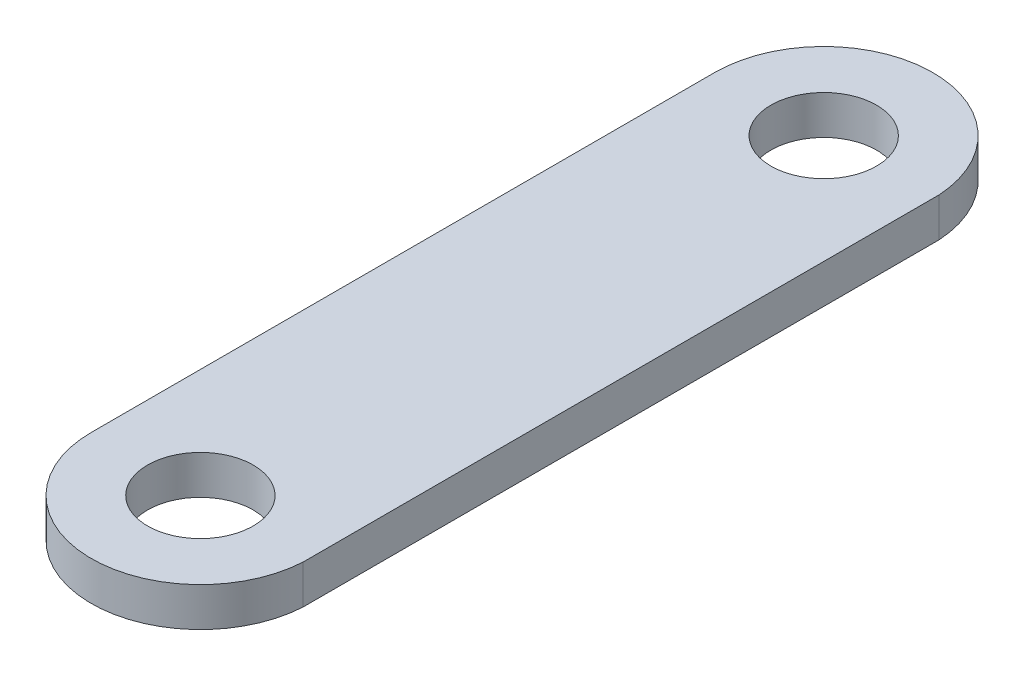
ISO-10303-21;
HEADER;
FILE_DESCRIPTION(('STEP AP214'),'2;1');
FILE_NAME('part.step','',(''),(''),'','','');
FILE_SCHEMA(('AUTOMOTIVE_DESIGN { 1 0 10303 214 1 1 1 1 }'));
ENDSEC;
DATA;
#1=APPLICATION_CONTEXT('core data for automotive mechanical design processes');
#2=APPLICATION_PROTOCOL_DEFINITION('international standard','automotive_design',2000,#1);
#3=PRODUCT_CONTEXT('',#1,'mechanical');
#4=PRODUCT('Part','Part','',(#3));
#5=PRODUCT_RELATED_PRODUCT_CATEGORY('part','',(#4));
#6=PRODUCT_DEFINITION_FORMATION('','',#4);
#7=PRODUCT_DEFINITION_CONTEXT('part definition',#1,'design');
#8=PRODUCT_DEFINITION('design','',#6,#7);
#9=PRODUCT_DEFINITION_SHAPE('','',#8);
#10=(LENGTH_UNIT() NAMED_UNIT(*) SI_UNIT(.MILLI.,.METRE.));
#11=(NAMED_UNIT(*) PLANE_ANGLE_UNIT() SI_UNIT($,.RADIAN.));
#12=(NAMED_UNIT(*) SI_UNIT($,.STERADIAN.) SOLID_ANGLE_UNIT());
#13=UNCERTAINTY_MEASURE_WITH_UNIT(LENGTH_MEASURE(1.E-05),#10,'distance_accuracy_value','');
#14=(GEOMETRIC_REPRESENTATION_CONTEXT(3) GLOBAL_UNCERTAINTY_ASSIGNED_CONTEXT((#13)) GLOBAL_UNIT_ASSIGNED_CONTEXT((#10,
#11,#12)) REPRESENTATION_CONTEXT('',''));
#15=CARTESIAN_POINT('',(0.,0.,0.));
#16=DIRECTION('',(0.,0.,1.));
#17=DIRECTION('',(1.,0.,0.));
#18=AXIS2_PLACEMENT_3D('',#15,#16,#17);
#19=CARTESIAN_POINT('',(0.00391637381463624,1.5875,-12.7));
#20=DIRECTION('',(0.,-1.,0.));
#21=DIRECTION('',(0.,0.,-1.));
#22=AXIS2_PLACEMENT_3D('',#19,#20,#21);
#23=PLANE('',#22);
#24=CARTESIAN_POINT('',(0.00391637381463624,1.5875,-12.7));
#25=DIRECTION('',(0.,1.,0.));
#26=DIRECTION('',(0.,0.,-1.));
#27=AXIS2_PLACEMENT_3D('',#24,#25,#26);
#28=CIRCLE('',#27,4.44891637381463);
#29=CARTESIAN_POINT('',(4.445,1.5875,-12.9638808943903));
#30=VERTEX_POINT('',#29);
#31=CARTESIAN_POINT('',(-4.445,1.5875,-12.7));
#32=VERTEX_POINT('',#31);
#33=EDGE_CURVE('E92',#30,#32,#28,.T.);
#34=ORIENTED_EDGE('',*,*,#33,.T.);
#35=DIRECTION('',(0.,0.,1.));
#36=VECTOR('',#35,1.);
#37=CARTESIAN_POINT('',(-4.445,1.5875,-12.7));
#38=LINE('',#37,#36);
#39=CARTESIAN_POINT('',(-4.445,1.5875,12.7));
#40=VERTEX_POINT('',#39);
#41=EDGE_CURVE('E87',#32,#40,#38,.T.);
#42=ORIENTED_EDGE('',*,*,#41,.T.);
#43=CARTESIAN_POINT('',(0.00391637381463624,1.5875,12.7));
#44=DIRECTION('',(0.,1.,0.));
#45=DIRECTION('',(0.,0.,1.));
#46=AXIS2_PLACEMENT_3D('',#43,#44,#45);
#47=CIRCLE('',#46,4.44891637381463);
#48=CARTESIAN_POINT('',(4.445,1.5875,12.9638808943903));
#49=VERTEX_POINT('',#48);
#50=EDGE_CURVE('E90',#40,#49,#47,.T.);
#51=ORIENTED_EDGE('',*,*,#50,.T.);
#52=DIRECTION('',(0.,0.,-1.));
#53=VECTOR('',#52,1.);
#54=CARTESIAN_POINT('',(4.445,1.5875,-12.9638808943903));
#55=LINE('',#54,#53);
#56=EDGE_CURVE('E57',#49,#30,#55,.T.);
#57=ORIENTED_EDGE('',*,*,#56,.T.);
#58=EDGE_LOOP('',(#34,#42,#51,#57));
#59=FACE_BOUND('',#58,.T.);
#60=CARTESIAN_POINT('',(0.00391637381463624,1.5875,12.7));
#61=DIRECTION('',(0.,1.,0.));
#62=DIRECTION('',(0.,0.,-1.));
#63=AXIS2_PLACEMENT_3D('',#60,#61,#62);
#64=CIRCLE('',#63,2.15265);
#65=CARTESIAN_POINT('',(0.00391637381463624,1.5875,10.54735));
#66=VERTEX_POINT('',#65);
#67=EDGE_CURVE('E112',#66,#66,#64,.T.);
#68=ORIENTED_EDGE('',*,*,#67,.F.);
#69=EDGE_LOOP('',(#68));
#70=FACE_BOUND('',#69,.T.);
#71=CARTESIAN_POINT('',(0.00391637381463624,1.5875,-12.7));
#72=DIRECTION('',(0.,1.,0.));
#73=DIRECTION('',(0.,0.,1.));
#74=AXIS2_PLACEMENT_3D('',#71,#72,#73);
#75=CIRCLE('',#74,2.15265);
#76=CARTESIAN_POINT('',(0.00391637381463624,1.5875,-10.54735));
#77=VERTEX_POINT('',#76);
#78=EDGE_CURVE('E134',#77,#77,#75,.T.);
#79=ORIENTED_EDGE('',*,*,#78,.F.);
#80=EDGE_LOOP('',(#79));
#81=FACE_BOUND('',#80,.T.);
#82=ADVANCED_FACE('F39',(#59,#70,#81),#23,.F.);
#83=CARTESIAN_POINT('',(0.00391637381463624,0.,-12.7));
#84=DIRECTION('',(0.,-1.,0.));
#85=DIRECTION('',(0.,0.,-1.));
#86=AXIS2_PLACEMENT_3D('',#83,#84,#85);
#87=PLANE('',#86);
#88=CARTESIAN_POINT('',(0.00391637381463624,0.,12.7));
#89=DIRECTION('',(0.,1.,0.));
#90=DIRECTION('',(0.,0.,-1.));
#91=AXIS2_PLACEMENT_3D('',#88,#89,#90);
#92=CIRCLE('',#91,2.15265);
#93=CARTESIAN_POINT('',(0.00391637381463624,0.,10.54735));
#94=VERTEX_POINT('',#93);
#95=EDGE_CURVE('E130',#94,#94,#92,.T.);
#96=ORIENTED_EDGE('',*,*,#95,.T.);
#97=EDGE_LOOP('',(#96));
#98=FACE_BOUND('',#97,.T.);
#99=CARTESIAN_POINT('',(0.00391637381463624,0.,-12.7));
#100=DIRECTION('',(0.,1.,0.));
#101=DIRECTION('',(0.,0.,-1.));
#102=AXIS2_PLACEMENT_3D('',#99,#100,#101);
#103=CIRCLE('',#102,4.44891637381463);
#104=CARTESIAN_POINT('',(4.445,0.,-12.9638808943903));
#105=VERTEX_POINT('',#104);
#106=CARTESIAN_POINT('',(-4.445,0.,-12.7));
#107=VERTEX_POINT('',#106);
#108=EDGE_CURVE('E108',#105,#107,#103,.T.);
#109=ORIENTED_EDGE('',*,*,#108,.F.);
#110=DIRECTION('',(0.,0.,-1.));
#111=VECTOR('',#110,1.);
#112=CARTESIAN_POINT('',(4.445,0.,-12.9638808943903));
#113=LINE('',#112,#111);
#114=CARTESIAN_POINT('',(4.445,0.,12.9638808943903));
#115=VERTEX_POINT('',#114);
#116=EDGE_CURVE('E80',#115,#105,#113,.T.);
#117=ORIENTED_EDGE('',*,*,#116,.F.);
#118=CARTESIAN_POINT('',(0.00391637381463624,0.,12.7));
#119=DIRECTION('',(0.,1.,0.));
#120=DIRECTION('',(0.,0.,1.));
#121=AXIS2_PLACEMENT_3D('',#118,#119,#120);
#122=CIRCLE('',#121,4.44891637381463);
#123=CARTESIAN_POINT('',(-4.445,0.,12.7));
#124=VERTEX_POINT('',#123);
#125=EDGE_CURVE('E74',#124,#115,#122,.T.);
#126=ORIENTED_EDGE('',*,*,#125,.F.);
#127=DIRECTION('',(0.,0.,1.));
#128=VECTOR('',#127,1.);
#129=CARTESIAN_POINT('',(-4.445,0.,-12.7));
#130=LINE('',#129,#128);
#131=EDGE_CURVE('E97',#107,#124,#130,.T.);
#132=ORIENTED_EDGE('',*,*,#131,.F.);
#133=EDGE_LOOP('',(#109,#117,#126,#132));
#134=FACE_BOUND('',#133,.T.);
#135=CARTESIAN_POINT('',(0.00391637381463624,0.,-12.7));
#136=DIRECTION('',(0.,1.,0.));
#137=DIRECTION('',(0.,0.,1.));
#138=AXIS2_PLACEMENT_3D('',#135,#136,#137);
#139=CIRCLE('',#138,2.15265);
#140=CARTESIAN_POINT('',(0.00391637381463624,0.,-10.54735));
#141=VERTEX_POINT('',#140);
#142=EDGE_CURVE('E138',#141,#141,#139,.T.);
#143=ORIENTED_EDGE('',*,*,#142,.T.);
#144=EDGE_LOOP('',(#143));
#145=FACE_BOUND('',#144,.T.);
#146=ADVANCED_FACE('F125',(#98,#134,#145),#87,.T.);
#147=CARTESIAN_POINT('',(0.00391637381463624,1.5875,-12.7));
#148=DIRECTION('',(0.,-1.,0.));
#149=DIRECTION('',(0.,0.,-1.));
#150=AXIS2_PLACEMENT_3D('',#147,#148,#149);
#151=CYLINDRICAL_SURFACE('',#150,4.44891637381463);
#152=ORIENTED_EDGE('',*,*,#108,.T.);
#153=DIRECTION('',(0.,-1.,0.));
#154=VECTOR('',#153,1.);
#155=CARTESIAN_POINT('',(-4.445,1.5875,-12.7));
#156=LINE('',#155,#154);
#157=EDGE_CURVE('E11',#32,#107,#156,.T.);
#158=ORIENTED_EDGE('',*,*,#157,.F.);
#159=ORIENTED_EDGE('',*,*,#33,.F.);
#160=DIRECTION('',(0.,-1.,0.));
#161=VECTOR('',#160,1.);
#162=CARTESIAN_POINT('',(4.445,1.5875,-12.9638808943903));
#163=LINE('',#162,#161);
#164=EDGE_CURVE('E104',#30,#105,#163,.T.);
#165=ORIENTED_EDGE('',*,*,#164,.T.);
#166=EDGE_LOOP('',(#152,#158,#159,#165));
#167=FACE_BOUND('',#166,.T.);
#168=ADVANCED_FACE('F41',(#167),#151,.T.);
#169=CARTESIAN_POINT('',(-4.445,1.5875,-12.7));
#170=DIRECTION('',(1.,0.,0.));
#171=DIRECTION('',(0.,0.,-1.));
#172=AXIS2_PLACEMENT_3D('',#169,#170,#171);
#173=PLANE('',#172);
#174=ORIENTED_EDGE('',*,*,#131,.T.);
#175=DIRECTION('',(0.,-1.,0.));
#176=VECTOR('',#175,1.);
#177=CARTESIAN_POINT('',(-4.445,1.5875,12.7));
#178=LINE('',#177,#176);
#179=EDGE_CURVE('E49',#40,#124,#178,.T.);
#180=ORIENTED_EDGE('',*,*,#179,.F.);
#181=ORIENTED_EDGE('',*,*,#41,.F.);
#182=ORIENTED_EDGE('',*,*,#157,.T.);
#183=EDGE_LOOP('',(#174,#180,#181,#182));
#184=FACE_BOUND('',#183,.T.);
#185=ADVANCED_FACE('F96',(#184),#173,.F.);
#186=CARTESIAN_POINT('',(0.00391637381463624,1.5875,12.7));
#187=DIRECTION('',(0.,-1.,0.));
#188=DIRECTION('',(0.,0.,-1.));
#189=AXIS2_PLACEMENT_3D('',#186,#187,#188);
#190=CYLINDRICAL_SURFACE('',#189,4.44891637381463);
#191=ORIENTED_EDGE('',*,*,#125,.T.);
#192=DIRECTION('',(0.,-1.,0.));
#193=VECTOR('',#192,1.);
#194=CARTESIAN_POINT('',(4.445,1.5875,12.9638808943903));
#195=LINE('',#194,#193);
#196=EDGE_CURVE('E99',#49,#115,#195,.T.);
#197=ORIENTED_EDGE('',*,*,#196,.F.);
#198=ORIENTED_EDGE('',*,*,#50,.F.);
#199=ORIENTED_EDGE('',*,*,#179,.T.);
#200=EDGE_LOOP('',(#191,#197,#198,#199));
#201=FACE_BOUND('',#200,.T.);
#202=ADVANCED_FACE('F100',(#201),#190,.T.);
#203=CARTESIAN_POINT('',(4.445,1.5875,-12.9638808943903));
#204=DIRECTION('',(-1.,0.,0.));
#205=DIRECTION('',(0.,0.,1.));
#206=AXIS2_PLACEMENT_3D('',#203,#204,#205);
#207=PLANE('',#206);
#208=ORIENTED_EDGE('',*,*,#116,.T.);
#209=ORIENTED_EDGE('',*,*,#164,.F.);
#210=ORIENTED_EDGE('',*,*,#56,.F.);
#211=ORIENTED_EDGE('',*,*,#196,.T.);
#212=EDGE_LOOP('',(#208,#209,#210,#211));
#213=FACE_BOUND('',#212,.T.);
#214=ADVANCED_FACE('F122',(#213),#207,.F.);
#215=CARTESIAN_POINT('',(0.00391637381463624,1.5875,12.7));
#216=DIRECTION('',(0.,-1.,0.));
#217=DIRECTION('',(0.,0.,-1.));
#218=AXIS2_PLACEMENT_3D('',#215,#216,#217);
#219=CYLINDRICAL_SURFACE('',#218,2.15265);
#220=ORIENTED_EDGE('',*,*,#67,.T.);
#221=EDGE_LOOP('',(#220));
#222=FACE_BOUND('',#221,.T.);
#223=ORIENTED_EDGE('',*,*,#95,.F.);
#224=EDGE_LOOP('',(#223));
#225=FACE_BOUND('',#224,.T.);
#226=ADVANCED_FACE('F157',(#222,#225),#219,.F.);
#227=CARTESIAN_POINT('',(0.00391637381463624,1.5875,-12.7));
#228=DIRECTION('',(0.,-1.,0.));
#229=DIRECTION('',(0.,0.,-1.));
#230=AXIS2_PLACEMENT_3D('',#227,#228,#229);
#231=CYLINDRICAL_SURFACE('',#230,2.15265);
#232=ORIENTED_EDGE('',*,*,#78,.T.);
#233=EDGE_LOOP('',(#232));
#234=FACE_BOUND('',#233,.T.);
#235=ORIENTED_EDGE('',*,*,#142,.F.);
#236=EDGE_LOOP('',(#235));
#237=FACE_BOUND('',#236,.T.);
#238=ADVANCED_FACE('F146',(#234,#237),#231,.F.);
#239=CLOSED_SHELL('',(#82,#146,#168,#185,#202,#214,#226,#238));
#240=MANIFOLD_SOLID_BREP('B2',#239);
#241=ADVANCED_BREP_SHAPE_REPRESENTATION('',(#18,#240),#14);
#242=SHAPE_DEFINITION_REPRESENTATION(#9,#241);
ENDSEC;
END-ISO-10303-21;
